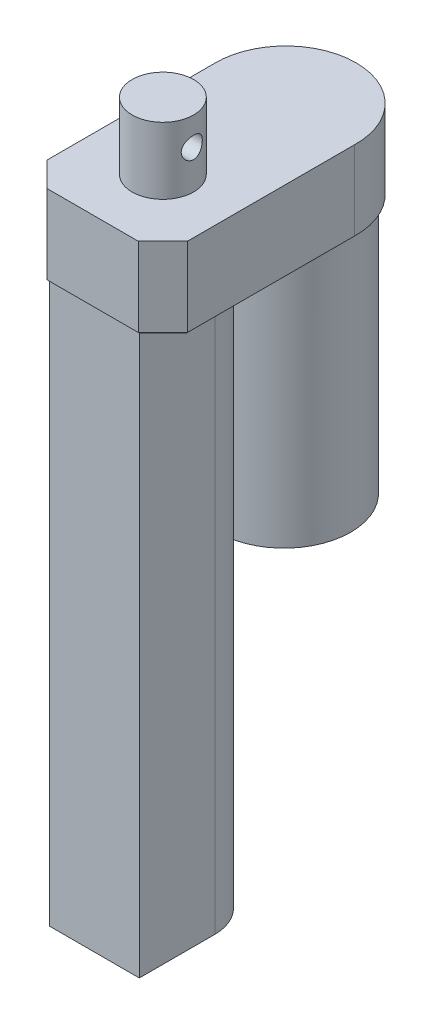
ISO-10303-21;
HEADER;
FILE_DESCRIPTION(('STEP AP214'),'2;1');
FILE_NAME('part.step','',(''),(''),'','','');
FILE_SCHEMA(('AUTOMOTIVE_DESIGN { 1 0 10303 214 1 1 1 1 }'));
ENDSEC;
DATA;
#1=APPLICATION_CONTEXT('core data for automotive mechanical design processes');
#2=APPLICATION_PROTOCOL_DEFINITION('international standard','automotive_design',2000,#1);
#3=PRODUCT_CONTEXT('',#1,'mechanical');
#4=PRODUCT('Part','Part','',(#3));
#5=PRODUCT_RELATED_PRODUCT_CATEGORY('part','',(#4));
#6=PRODUCT_DEFINITION_FORMATION('','',#4);
#7=PRODUCT_DEFINITION_CONTEXT('part definition',#1,'design');
#8=PRODUCT_DEFINITION('design','',#6,#7);
#9=PRODUCT_DEFINITION_SHAPE('','',#8);
#10=(LENGTH_UNIT() NAMED_UNIT(*) SI_UNIT(.MILLI.,.METRE.));
#11=(NAMED_UNIT(*) PLANE_ANGLE_UNIT() SI_UNIT($,.RADIAN.));
#12=(NAMED_UNIT(*) SI_UNIT($,.STERADIAN.) SOLID_ANGLE_UNIT());
#13=UNCERTAINTY_MEASURE_WITH_UNIT(LENGTH_MEASURE(1.E-05),#10,'distance_accuracy_value','');
#14=(GEOMETRIC_REPRESENTATION_CONTEXT(3) GLOBAL_UNCERTAINTY_ASSIGNED_CONTEXT((#13)) GLOBAL_UNIT_ASSIGNED_CONTEXT((#10,
#11,#12)) REPRESENTATION_CONTEXT('',''));
#15=CARTESIAN_POINT('',(0.,0.,0.));
#16=DIRECTION('',(0.,0.,1.));
#17=DIRECTION('',(1.,0.,0.));
#18=AXIS2_PLACEMENT_3D('',#15,#16,#17);
#19=CARTESIAN_POINT('',(0.,0.,-27.7439024390244));
#20=DIRECTION('',(0.,1.,0.));
#21=DIRECTION('',(0.,0.,1.));
#22=AXIS2_PLACEMENT_3D('',#19,#20,#21);
#23=PLANE('',#22);
#24=CARTESIAN_POINT('',(0.,0.,-27.25));
#25=DIRECTION('',(0.,1.,0.));
#26=DIRECTION('',(0.,0.,1.));
#27=AXIS2_PLACEMENT_3D('',#24,#25,#26);
#28=CIRCLE('',#27,19.);
#29=CARTESIAN_POINT('',(0.,0.,-8.25));
#30=VERTEX_POINT('',#29);
#31=EDGE_CURVE('E11',#30,#30,#28,.F.);
#32=ORIENTED_EDGE('',*,*,#31,.F.);
#33=EDGE_LOOP('',(#32));
#34=FACE_BOUND('',#33,.T.);
#35=DIRECTION('',(0.,0.,-1.));
#36=VECTOR('',#35,1.);
#37=CARTESIAN_POINT('',(-12.7928932188134,0.,0.));
#38=LINE('',#37,#36);
#39=CARTESIAN_POINT('',(-12.7928932188134,0.,26.75));
#40=VERTEX_POINT('',#39);
#41=CARTESIAN_POINT('',(-12.7928932188134,0.,5.25));
#42=VERTEX_POINT('',#41);
#43=EDGE_CURVE('E154',#40,#42,#38,.T.);
#44=ORIENTED_EDGE('',*,*,#43,.F.);
#45=DIRECTION('',(-0.707106781186546,0.,-0.707106781186549));
#46=VECTOR('',#45,1.);
#47=CARTESIAN_POINT('',(-19.6464466094067,0.,19.8964466094067));
#48=LINE('',#47,#46);
#49=CARTESIAN_POINT('',(-19.5,0.,20.0428932188134));
#50=VERTEX_POINT('',#49);
#51=EDGE_CURVE('E214',#40,#50,#48,.T.);
#52=ORIENTED_EDGE('',*,*,#51,.T.);
#53=DIRECTION('',(0.,0.,-1.));
#54=VECTOR('',#53,1.);
#55=CARTESIAN_POINT('',(-19.5,0.,-27.7439024390244));
#56=LINE('',#55,#54);
#57=CARTESIAN_POINT('',(-19.5,0.,-27.256211903645));
#58=VERTEX_POINT('',#57);
#59=EDGE_CURVE('E216',#50,#58,#56,.T.);
#60=ORIENTED_EDGE('',*,*,#59,.T.);
#61=CARTESIAN_POINT('',(0.,0.,-27.7439024390244));
#62=DIRECTION('',(0.,1.,0.));
#63=DIRECTION('',(0.,0.,1.));
#64=AXIS2_PLACEMENT_3D('',#61,#62,#63);
#65=CIRCLE('',#64,19.5060975609756);
#66=CARTESIAN_POINT('',(19.5,0.,-27.256211903645));
#67=VERTEX_POINT('',#66);
#68=EDGE_CURVE('E218',#58,#67,#65,.F.);
#69=ORIENTED_EDGE('',*,*,#68,.T.);
#70=DIRECTION('',(0.,0.,1.));
#71=VECTOR('',#70,1.);
#72=CARTESIAN_POINT('',(19.5,0.,-27.7439024390244));
#73=LINE('',#72,#71);
#74=CARTESIAN_POINT('',(19.5,0.,20.0428932188135));
#75=VERTEX_POINT('',#74);
#76=EDGE_CURVE('E207',#67,#75,#73,.T.);
#77=ORIENTED_EDGE('',*,*,#76,.T.);
#78=DIRECTION('',(-0.707106781186549,0.,0.707106781186546));
#79=VECTOR('',#78,1.);
#80=CARTESIAN_POINT('',(12.6464466094067,0.,26.8964466094067));
#81=LINE('',#80,#79);
#82=CARTESIAN_POINT('',(12.7928932188134,0.,26.75));
#83=VERTEX_POINT('',#82);
#84=EDGE_CURVE('E209',#75,#83,#81,.T.);
#85=ORIENTED_EDGE('',*,*,#84,.T.);
#86=DIRECTION('',(0.,0.,1.));
#87=VECTOR('',#86,1.);
#88=CARTESIAN_POINT('',(12.7928932188134,0.,0.));
#89=LINE('',#88,#87);
#90=CARTESIAN_POINT('',(12.7928932188134,0.,5.25));
#91=VERTEX_POINT('',#90);
#92=EDGE_CURVE('E65',#91,#83,#89,.T.);
#93=ORIENTED_EDGE('',*,*,#92,.F.);
#94=CARTESIAN_POINT('',(0.,0.,5.25));
#95=DIRECTION('',(0.,-1.,0.));
#96=DIRECTION('',(0.,0.,-1.));
#97=AXIS2_PLACEMENT_3D('',#94,#95,#96);
#98=CIRCLE('',#97,12.7928932188134);
#99=EDGE_CURVE('E60',#42,#91,#98,.T.);
#100=ORIENTED_EDGE('',*,*,#99,.F.);
#101=EDGE_LOOP('',(#44,#52,#60,#69,#77,#85,#93,#100));
#102=FACE_BOUND('',#101,.T.);
#103=ADVANCED_FACE('F38',(#34,#102),#23,.F.);
#104=CARTESIAN_POINT('',(0.,23.,-27.7439024390244));
#105=DIRECTION('',(0.,-1.,0.));
#106=DIRECTION('',(0.,0.,-1.));
#107=AXIS2_PLACEMENT_3D('',#104,#105,#106);
#108=CYLINDRICAL_SURFACE('',#107,20.0060975609756);
#109=DIRECTION('',(0.,-1.,0.));
#110=VECTOR('',#109,1.);
#111=CARTESIAN_POINT('',(20.,23.,-27.25));
#112=LINE('',#111,#110);
#113=CARTESIAN_POINT('',(20.,23.,-27.25));
#114=VERTEX_POINT('',#113);
#115=CARTESIAN_POINT('',(20.,0.5,-27.25));
#116=VERTEX_POINT('',#115);
#117=EDGE_CURVE('E184',#114,#116,#112,.T.);
#118=ORIENTED_EDGE('',*,*,#117,.T.);
#119=CARTESIAN_POINT('',(0.,0.5,-27.7439024390244));
#120=DIRECTION('',(0.,1.,0.));
#121=DIRECTION('',(0.,0.,1.));
#122=AXIS2_PLACEMENT_3D('',#119,#120,#121);
#123=CIRCLE('',#122,20.0060975609756);
#124=CARTESIAN_POINT('',(-20.,0.5,-27.25));
#125=VERTEX_POINT('',#124);
#126=EDGE_CURVE('E204',#116,#125,#123,.T.);
#127=ORIENTED_EDGE('',*,*,#126,.T.);
#128=DIRECTION('',(0.,-1.,0.));
#129=VECTOR('',#128,1.);
#130=CARTESIAN_POINT('',(-20.,23.,-27.25));
#131=LINE('',#130,#129);
#132=CARTESIAN_POINT('',(-20.,23.,-27.25));
#133=VERTEX_POINT('',#132);
#134=EDGE_CURVE('E187',#133,#125,#131,.T.);
#135=ORIENTED_EDGE('',*,*,#134,.F.);
#136=CARTESIAN_POINT('',(0.,23.,-27.7439024390244));
#137=DIRECTION('',(0.,1.,0.));
#138=DIRECTION('',(0.,0.,1.));
#139=AXIS2_PLACEMENT_3D('',#136,#137,#138);
#140=CIRCLE('',#139,20.0060975609756);
#141=EDGE_CURVE('E169',#114,#133,#140,.T.);
#142=ORIENTED_EDGE('',*,*,#141,.F.);
#143=EDGE_LOOP('',(#118,#127,#135,#142));
#144=FACE_BOUND('',#143,.T.);
#145=ADVANCED_FACE('F269',(#144),#108,.T.);
#146=CARTESIAN_POINT('',(-20.,23.,27.25));
#147=DIRECTION('',(1.,0.,0.));
#148=DIRECTION('',(0.,0.,-1.));
#149=AXIS2_PLACEMENT_3D('',#146,#147,#148);
#150=PLANE('',#149);
#151=ORIENTED_EDGE('',*,*,#134,.T.);
#152=DIRECTION('',(0.,0.,1.));
#153=VECTOR('',#152,1.);
#154=CARTESIAN_POINT('',(-20.,0.5,27.25));
#155=LINE('',#154,#153);
#156=CARTESIAN_POINT('',(-20.,0.5,20.25));
#157=VERTEX_POINT('',#156);
#158=EDGE_CURVE('E221',#125,#157,#155,.T.);
#159=ORIENTED_EDGE('',*,*,#158,.T.);
#160=DIRECTION('',(0.,1.,0.));
#161=VECTOR('',#160,1.);
#162=CARTESIAN_POINT('',(-20.,23.,20.25));
#163=LINE('',#162,#161);
#164=CARTESIAN_POINT('',(-20.,23.,20.25));
#165=VERTEX_POINT('',#164);
#166=EDGE_CURVE('E202',#157,#165,#163,.T.);
#167=ORIENTED_EDGE('',*,*,#166,.T.);
#168=DIRECTION('',(0.,0.,1.));
#169=VECTOR('',#168,1.);
#170=CARTESIAN_POINT('',(-20.,23.,27.25));
#171=LINE('',#170,#169);
#172=EDGE_CURVE('E176',#133,#165,#171,.T.);
#173=ORIENTED_EDGE('',*,*,#172,.F.);
#174=EDGE_LOOP('',(#151,#159,#167,#173));
#175=FACE_BOUND('',#174,.T.);
#176=ADVANCED_FACE('F275',(#175),#150,.F.);
#177=CARTESIAN_POINT('',(-20.,23.,27.25));
#178=DIRECTION('',(0.,0.,-1.));
#179=DIRECTION('',(-1.,0.,0.));
#180=AXIS2_PLACEMENT_3D('',#177,#178,#179);
#181=PLANE('',#180);
#182=DIRECTION('',(0.,-1.,0.));
#183=VECTOR('',#182,1.);
#184=CARTESIAN_POINT('',(-13.,23.,27.25));
#185=LINE('',#184,#183);
#186=CARTESIAN_POINT('',(-13.,23.,27.25));
#187=VERTEX_POINT('',#186);
#188=CARTESIAN_POINT('',(-13.,0.5,27.25));
#189=VERTEX_POINT('',#188);
#190=EDGE_CURVE('E193',#187,#189,#185,.T.);
#191=ORIENTED_EDGE('',*,*,#190,.T.);
#192=DIRECTION('',(1.,0.,0.));
#193=VECTOR('',#192,1.);
#194=CARTESIAN_POINT('',(-20.,0.5,27.25));
#195=LINE('',#194,#193);
#196=CARTESIAN_POINT('',(13.,0.5,27.25));
#197=VERTEX_POINT('',#196);
#198=EDGE_CURVE('E225',#189,#197,#195,.T.);
#199=ORIENTED_EDGE('',*,*,#198,.T.);
#200=DIRECTION('',(0.,1.,0.));
#201=VECTOR('',#200,1.);
#202=CARTESIAN_POINT('',(13.,23.,27.25));
#203=LINE('',#202,#201);
#204=CARTESIAN_POINT('',(13.,23.,27.25));
#205=VERTEX_POINT('',#204);
#206=EDGE_CURVE('E196',#197,#205,#203,.T.);
#207=ORIENTED_EDGE('',*,*,#206,.T.);
#208=DIRECTION('',(1.,0.,0.));
#209=VECTOR('',#208,1.);
#210=CARTESIAN_POINT('',(-20.,23.,27.25));
#211=LINE('',#210,#209);
#212=EDGE_CURVE('E179',#187,#205,#211,.T.);
#213=ORIENTED_EDGE('',*,*,#212,.F.);
#214=EDGE_LOOP('',(#191,#199,#207,#213));
#215=FACE_BOUND('',#214,.T.);
#216=ADVANCED_FACE('F285',(#215),#181,.F.);
#217=CARTESIAN_POINT('',(20.,23.,27.25));
#218=DIRECTION('',(-1.,0.,0.));
#219=DIRECTION('',(0.,0.,1.));
#220=AXIS2_PLACEMENT_3D('',#217,#218,#219);
#221=PLANE('',#220);
#222=DIRECTION('',(0.,-1.,0.));
#223=VECTOR('',#222,1.);
#224=CARTESIAN_POINT('',(20.,23.,20.25));
#225=LINE('',#224,#223);
#226=CARTESIAN_POINT('',(20.,23.,20.25));
#227=VERTEX_POINT('',#226);
#228=CARTESIAN_POINT('',(20.,0.5,20.25));
#229=VERTEX_POINT('',#228);
#230=EDGE_CURVE('E190',#227,#229,#225,.T.);
#231=ORIENTED_EDGE('',*,*,#230,.T.);
#232=DIRECTION('',(0.,0.,-1.));
#233=VECTOR('',#232,1.);
#234=CARTESIAN_POINT('',(20.,0.5,27.25));
#235=LINE('',#234,#233);
#236=EDGE_CURVE('E52',#229,#116,#235,.T.);
#237=ORIENTED_EDGE('',*,*,#236,.T.);
#238=ORIENTED_EDGE('',*,*,#117,.F.);
#239=DIRECTION('',(0.,0.,-1.));
#240=VECTOR('',#239,1.);
#241=CARTESIAN_POINT('',(20.,23.,27.25));
#242=LINE('',#241,#240);
#243=EDGE_CURVE('E182',#227,#114,#242,.T.);
#244=ORIENTED_EDGE('',*,*,#243,.F.);
#245=EDGE_LOOP('',(#231,#237,#238,#244));
#246=FACE_BOUND('',#245,.T.);
#247=ADVANCED_FACE('F282',(#246),#221,.F.);
#248=CARTESIAN_POINT('',(0.,23.,-27.7439024390244));
#249=DIRECTION('',(0.,1.,0.));
#250=DIRECTION('',(0.,0.,1.));
#251=AXIS2_PLACEMENT_3D('',#248,#249,#250);
#252=PLANE('',#251);
#253=CARTESIAN_POINT('',(0.,23.,7.25));
#254=DIRECTION('',(0.,1.,0.));
#255=DIRECTION('',(0.,0.,1.));
#256=AXIS2_PLACEMENT_3D('',#253,#254,#255);
#257=CIRCLE('',#256,8.75);
#258=CARTESIAN_POINT('',(0.,23.,16.));
#259=VERTEX_POINT('',#258);
#260=EDGE_CURVE('E170',#259,#259,#257,.T.);
#261=ORIENTED_EDGE('',*,*,#260,.F.);
#262=EDGE_LOOP('',(#261));
#263=FACE_BOUND('',#262,.T.);
#264=ORIENTED_EDGE('',*,*,#212,.T.);
#265=DIRECTION('',(-0.707106781186549,0.,0.707106781186546));
#266=VECTOR('',#265,1.);
#267=CARTESIAN_POINT('',(33.9969512195122,23.,6.25304878048787));
#268=LINE('',#267,#266);
#269=EDGE_CURVE('E200',#205,#227,#268,.F.);
#270=ORIENTED_EDGE('',*,*,#269,.T.);
#271=ORIENTED_EDGE('',*,*,#243,.T.);
#272=ORIENTED_EDGE('',*,*,#141,.T.);
#273=ORIENTED_EDGE('',*,*,#172,.T.);
#274=DIRECTION('',(-0.707106781186546,0.,-0.707106781186549));
#275=VECTOR('',#274,1.);
#276=CARTESIAN_POINT('',(-33.9969512195122,23.,6.25304878048772));
#277=LINE('',#276,#275);
#278=EDGE_CURVE('E198',#165,#187,#277,.F.);
#279=ORIENTED_EDGE('',*,*,#278,.T.);
#280=EDGE_LOOP('',(#264,#270,#271,#272,#273,#279));
#281=FACE_BOUND('',#280,.T.);
#282=ADVANCED_FACE('F281',(#263,#281),#252,.T.);
#283=CARTESIAN_POINT('',(20.,23.,20.25));
#284=DIRECTION('',(-0.707106781186546,0.,-0.707106781186549));
#285=DIRECTION('',(0.,-1.,0.));
#286=AXIS2_PLACEMENT_3D('',#283,#284,#285);
#287=PLANE('',#286);
#288=ORIENTED_EDGE('',*,*,#206,.F.);
#289=DIRECTION('',(-0.707106781186549,0.,0.707106781186546));
#290=VECTOR('',#289,1.);
#291=CARTESIAN_POINT('',(20.,0.5,20.25));
#292=LINE('',#291,#290);
#293=EDGE_CURVE('E227',#197,#229,#292,.F.);
#294=ORIENTED_EDGE('',*,*,#293,.T.);
#295=ORIENTED_EDGE('',*,*,#230,.F.);
#296=ORIENTED_EDGE('',*,*,#269,.F.);
#297=EDGE_LOOP('',(#288,#294,#295,#296));
#298=FACE_BOUND('',#297,.T.);
#299=ADVANCED_FACE('F293',(#298),#287,.F.);
#300=CARTESIAN_POINT('',(-13.,23.,27.25));
#301=DIRECTION('',(0.707106781186549,0.,-0.707106781186546));
#302=DIRECTION('',(0.,-1.,0.));
#303=AXIS2_PLACEMENT_3D('',#300,#301,#302);
#304=PLANE('',#303);
#305=ORIENTED_EDGE('',*,*,#166,.F.);
#306=DIRECTION('',(-0.707106781186546,0.,-0.707106781186549));
#307=VECTOR('',#306,1.);
#308=CARTESIAN_POINT('',(-13.,0.500000000000001,27.25));
#309=LINE('',#308,#307);
#310=EDGE_CURVE('E223',#157,#189,#309,.F.);
#311=ORIENTED_EDGE('',*,*,#310,.T.);
#312=ORIENTED_EDGE('',*,*,#190,.F.);
#313=ORIENTED_EDGE('',*,*,#278,.F.);
#314=EDGE_LOOP('',(#305,#311,#312,#313));
#315=FACE_BOUND('',#314,.T.);
#316=ADVANCED_FACE('F295',(#315),#304,.F.);
#317=CARTESIAN_POINT('',(0.,42.,7.25));
#318=DIRECTION('',(0.,-1.,0.));
#319=DIRECTION('',(0.,0.,-1.));
#320=AXIS2_PLACEMENT_3D('',#317,#318,#319);
#321=CYLINDRICAL_SURFACE('',#320,8.75);
#322=CARTESIAN_POINT('',(-8.2196411113868,34.,4.25));
#323=CARTESIAN_POINT('',(-8.21963966696499,34.1631026677264,4.24999821199337));
#324=CARTESIAN_POINT('',(-8.22454879313556,34.3261930090845,4.26334607855193));
#325=CARTESIAN_POINT('',(-8.24354529034157,34.6475229389937,4.31619133361418));
#326=CARTESIAN_POINT('',(-8.25763374103735,34.8057619546453,4.35569179816168));
#327=CARTESIAN_POINT('',(-8.29320953916202,35.1126783509252,4.45927637699315));
#328=CARTESIAN_POINT('',(-8.31468169000744,35.2613746316122,4.52331002955212));
#329=CARTESIAN_POINT('',(-8.36258290594314,35.5459647520904,4.67396938643779));
#330=CARTESIAN_POINT('',(-8.38901316058877,35.6818555077828,4.76060051433486));
#331=CARTESIAN_POINT('',(-8.44508015335536,35.942606039379,4.95783961590905));
#332=CARTESIAN_POINT('',(-8.47480011343842,36.0668585110533,5.0692269904548));
#333=CARTESIAN_POINT('',(-8.53339647944575,36.2953371918525,5.31115547250579));
#334=CARTESIAN_POINT('',(-8.56227274016146,36.3995599706962,5.4416998540969));
#335=CARTESIAN_POINT('',(-8.61689727547401,36.5878130452084,5.72271457310106));
#336=CARTESIAN_POINT('',(-8.64253634317682,36.6712018148212,5.87363778054657));
#337=CARTESIAN_POINT('',(-8.68681281914156,36.8111646786476,6.18840043871628));
#338=CARTESIAN_POINT('',(-8.70545223081177,36.8677464466486,6.35223617740962));
#339=CARTESIAN_POINT('',(-8.73303950244701,36.9504144080879,6.68180185040079));
#340=CARTESIAN_POINT('',(-8.74231746635867,36.9775420898004,6.84724238566389));
#341=CARTESIAN_POINT('',(-8.7513110578293,37.0038489637629,7.18057007356003));
#342=CARTESIAN_POINT('',(-8.75102928980447,37.0030357681162,7.34845654737247));
#343=CARTESIAN_POINT('',(-8.74115588060926,36.9741327793623,7.67451840318935));
#344=CARTESIAN_POINT('',(-8.73195074331423,36.947175366136,7.83280780717064));
#345=CARTESIAN_POINT('',(-8.70575489999197,36.8686288000134,8.14246230437054));
#346=CARTESIAN_POINT('',(-8.68876365908347,36.8170379548663,8.2938269210918));
#347=CARTESIAN_POINT('',(-8.64842501286197,36.6900584980084,8.58774682084455));
#348=CARTESIAN_POINT('',(-8.62499479354297,36.6143576296963,8.7301553676012));
#349=CARTESIAN_POINT('',(-8.57420241941931,36.4415680779828,9.00057446449465));
#350=CARTESIAN_POINT('',(-8.54683912884594,36.3444732122198,9.12858083655643));
#351=CARTESIAN_POINT('',(-8.48944850567277,36.1259988728825,9.3732864729827));
#352=CARTESIAN_POINT('',(-8.45935635609438,36.0036533413404,9.48910931619769));
#353=CARTESIAN_POINT('',(-8.40103160366621,35.7410338478009,9.69888789551482));
#354=CARTESIAN_POINT('',(-8.37279932364301,35.6007567857005,9.79283984251247));
#355=CARTESIAN_POINT('',(-8.32102377112971,35.3033322988642,9.95751950566393));
#356=CARTESIAN_POINT('',(-8.2975619198116,35.1459527022397,10.0278554782275));
#357=CARTESIAN_POINT('',(-8.25892402122806,34.8205738756784,10.1407222309304));
#358=CARTESIAN_POINT('',(-8.24374425888971,34.6525794450036,10.1832654796652));
#359=CARTESIAN_POINT('',(-8.22423759406534,34.319270193321,10.2375093937651));
#360=CARTESIAN_POINT('',(-8.21943030120823,34.1542059006265,10.2505766127404));
#361=CARTESIAN_POINT('',(-8.21986609325329,33.8242081805408,10.249384558195));
#362=CARTESIAN_POINT('',(-8.22510721427078,33.6592747338794,10.2351306243822));
#363=CARTESIAN_POINT('',(-8.24456830823428,33.3406032709185,10.1809315627575));
#364=CARTESIAN_POINT('',(-8.25844819778452,33.1866768929378,10.1419584952316));
#365=CARTESIAN_POINT('',(-8.29324232389215,32.8875871163843,10.0406061457153));
#366=CARTESIAN_POINT('',(-8.3141578521977,32.7424253327738,9.97822256529509));
#367=CARTESIAN_POINT('',(-8.36152229337208,32.4596592391811,9.82947906160251));
#368=CARTESIAN_POINT('',(-8.38813137799001,32.3224638408889,9.74239419482448));
#369=CARTESIAN_POINT('',(-8.44358342820308,32.064141171528,9.54753030073554));
#370=CARTESIAN_POINT('',(-8.47242708698829,31.9430189183965,9.43974483640611));
#371=CARTESIAN_POINT('',(-8.5308903700107,31.7138442880211,9.19996900691919));
#372=CARTESIAN_POINT('',(-8.56047373735717,31.6067829763372,9.06701964834227));
#373=CARTESIAN_POINT('',(-8.61563093416445,31.4164136636205,8.78431267120997));
#374=CARTESIAN_POINT('',(-8.64120487981175,31.3331049742183,8.63455553993225));
#375=CARTESIAN_POINT('',(-8.68535987286581,31.1933362112036,8.32311716911724));
#376=CARTESIAN_POINT('',(-8.70398280844663,31.1367147529628,8.16151461612874));
#377=CARTESIAN_POINT('',(-8.73231423186321,31.0517059044869,7.83031163558396));
#378=CARTESIAN_POINT('',(-8.74202614581118,31.0233076626317,7.66071430825193));
#379=CARTESIAN_POINT('',(-8.75116789234191,30.9965720145565,7.32737571744395));
#380=CARTESIAN_POINT('',(-8.75108311611696,30.9968155225997,7.16376039845709));
#381=CARTESIAN_POINT('',(-8.74185154282233,31.023823058207,6.83901025845031));
#382=CARTESIAN_POINT('',(-8.73270555403372,31.0505847202907,6.67787521748582));
#383=CARTESIAN_POINT('',(-8.70656769128771,31.1289125222774,6.36550014016176));
#384=CARTESIAN_POINT('',(-8.68971687054434,31.1800333957826,6.21413579640993));
#385=CARTESIAN_POINT('',(-8.64990647437029,31.3052102418289,5.92208285407036));
#386=CARTESIAN_POINT('',(-8.62694577482648,31.379270435224,5.78139622612738));
#387=CARTESIAN_POINT('',(-8.5761737217924,31.5514762670169,5.50882064815411));
#388=CARTESIAN_POINT('',(-8.54821044613054,31.6504346856282,5.37747390102216));
#389=CARTESIAN_POINT('',(-8.49092159348734,31.8682685540706,5.13279185270617));
#390=CARTESIAN_POINT('',(-8.46159557157982,31.9871505422868,5.01946248821678));
#391=CARTESIAN_POINT('',(-8.40340801901877,32.2474316909771,4.80916985898143));
#392=CARTESIAN_POINT('',(-8.37461796951372,32.3895678964295,4.71309601680038));
#393=CARTESIAN_POINT('',(-8.32225317575394,32.688873264318,4.5462462043968));
#394=CARTESIAN_POINT('',(-8.29867745126572,32.8460395932918,4.4754654778148));
#395=CARTESIAN_POINT('',(-8.26025973071726,33.1668972288271,4.36312123829911));
#396=CARTESIAN_POINT('',(-8.24520703193571,33.3303134963923,4.32084741203481));
#397=CARTESIAN_POINT('',(-8.22490043606385,33.662492356516,4.26429333610913));
#398=CARTESIAN_POINT('',(-8.21964260579627,33.831252775407,4.25000184988486));
#399=CARTESIAN_POINT('',(-8.2196411113868,34.,4.25));
#400=B_SPLINE_CURVE_WITH_KNOTS('',3,(#322,#323,#324,#325,#326,#327,#328,#329,#330,#331,#332,
#333,#334,#335,#336,#337,#338,#339,#340,#341,#342,#343,#344,#345,#346,#347,#348,#349,#350,#351,
#352,#353,#354,#355,#356,#357,#358,#359,#360,#361,#362,#363,#364,#365,#366,#367,#368,#369,#370,
#371,#372,#373,#374,#375,#376,#377,#378,#379,#380,#381,#382,#383,#384,#385,#386,#387,#388,#389,
#390,#391,#392,#393,#394,#395,#396,#397,#398,#399),.UNSPECIFIED.,.T.,.F.,(4,2,2,2,2,2,2,2,2,2,2,
2,2,2,2,2,2,2,2,2,2,2,2,2,2,2,2,2,2,2,2,2,2,2,2,2,2,2,4),(0.,0.488682337219747,
0.977422163006771,1.46516206218575,1.95301913062753,2.45922932278978,2.9655261313039,
3.48589073327405,4.00610628524081,4.5072593455663,5.00827587479767,5.48851853048441,
5.96879418230657,6.45556189842432,6.9424704638653,7.4535433316787,7.96470467641856,
8.48396864418949,9.00299949530807,9.4974244192431,9.99175272150508,10.4677544221134,
10.9438435647083,11.4356834532261,11.9276765317009,12.4449440528246,12.9621965816088,
13.4762796922962,13.9901650652326,14.4786007186933,14.966992806489,15.446781266494,
15.9266580604689,16.4248866674341,16.9232791010886,17.4426450771838,17.9619133352713,
18.467710839701,18.9733051948578),.UNSPECIFIED.);
#401=CARTESIAN_POINT('',(-8.2196411113868,34.,4.25));
#402=VERTEX_POINT('',#401);
#403=EDGE_CURVE('E42',#402,#402,#400,.T.);
#404=ORIENTED_EDGE('',*,*,#403,.T.);
#405=EDGE_LOOP('',(#404));
#406=FACE_BOUND('',#405,.T.);
#407=CARTESIAN_POINT('',(8.2196411113868,34.,4.25));
#408=CARTESIAN_POINT('',(8.21963966696499,33.8368973322736,4.24999821199337));
#409=CARTESIAN_POINT('',(8.22454879313556,33.6738069909155,4.26334607855193));
#410=CARTESIAN_POINT('',(8.24354529034157,33.3524770610063,4.31619133361418));
#411=CARTESIAN_POINT('',(8.25763374103735,33.1942380453547,4.35569179816168));
#412=CARTESIAN_POINT('',(8.29320953916202,32.8873216490748,4.45927637699315));
#413=CARTESIAN_POINT('',(8.31468169000744,32.7386253683878,4.52331002955212));
#414=CARTESIAN_POINT('',(8.36258290594314,32.4540352479096,4.67396938643779));
#415=CARTESIAN_POINT('',(8.38901316058877,32.3181444922172,4.76060051433486));
#416=CARTESIAN_POINT('',(8.44508015335536,32.057393960621,4.95783961590905));
#417=CARTESIAN_POINT('',(8.47480011343842,31.9331414889467,5.0692269904548));
#418=CARTESIAN_POINT('',(8.53339647944575,31.7046628081475,5.31115547250579));
#419=CARTESIAN_POINT('',(8.56227274016146,31.6004400293038,5.4416998540969));
#420=CARTESIAN_POINT('',(8.61689727547401,31.4121869547916,5.72271457310106));
#421=CARTESIAN_POINT('',(8.64253634317682,31.3287981851788,5.87363778054657));
#422=CARTESIAN_POINT('',(8.68681281914156,31.1888353213524,6.18840043871628));
#423=CARTESIAN_POINT('',(8.70545223081177,31.1322535533514,6.35223617740962));
#424=CARTESIAN_POINT('',(8.73303950244701,31.0495855919121,6.68180185040079));
#425=CARTESIAN_POINT('',(8.74231746635867,31.0224579101996,6.84724238566389));
#426=CARTESIAN_POINT('',(8.7513110578293,30.996151036237,7.18057007356003));
#427=CARTESIAN_POINT('',(8.75102928980447,30.9969642318838,7.34845654737247));
#428=CARTESIAN_POINT('',(8.74115588060926,31.0258672206377,7.67451840318935));
#429=CARTESIAN_POINT('',(8.73195074331423,31.052824633864,7.83280780717064));
#430=CARTESIAN_POINT('',(8.70575489999197,31.1313711999866,8.14246230437054));
#431=CARTESIAN_POINT('',(8.68876365908347,31.1829620451337,8.2938269210918));
#432=CARTESIAN_POINT('',(8.64842501286197,31.3099415019915,8.58774682084455));
#433=CARTESIAN_POINT('',(8.62499479354297,31.3856423703037,8.7301553676012));
#434=CARTESIAN_POINT('',(8.57420241941931,31.5584319220172,9.00057446449465));
#435=CARTESIAN_POINT('',(8.54683912884594,31.6555267877801,9.12858083655643));
#436=CARTESIAN_POINT('',(8.48944850567277,31.8740011271175,9.3732864729827));
#437=CARTESIAN_POINT('',(8.45935635609438,31.9963466586595,9.48910931619769));
#438=CARTESIAN_POINT('',(8.40103160366621,32.2589661521991,9.69888789551482));
#439=CARTESIAN_POINT('',(8.372799323643,32.3992432142995,9.79283984251248));
#440=CARTESIAN_POINT('',(8.32102377112971,32.6966677011358,9.95751950566393));
#441=CARTESIAN_POINT('',(8.2975619198116,32.8540472977603,10.0278554782275));
#442=CARTESIAN_POINT('',(8.25892402122806,33.1794261243216,10.1407222309304));
#443=CARTESIAN_POINT('',(8.24374425888971,33.3474205549964,10.1832654796652));
#444=CARTESIAN_POINT('',(8.22423759406534,33.680729806679,10.2375093937651));
#445=CARTESIAN_POINT('',(8.21943030120823,33.8457940993735,10.2505766127404));
#446=CARTESIAN_POINT('',(8.21986609325329,34.1757918194592,10.249384558195));
#447=CARTESIAN_POINT('',(8.22510721427078,34.3407252661206,10.2351306243822));
#448=CARTESIAN_POINT('',(8.24456830823428,34.6593967290815,10.1809315627575));
#449=CARTESIAN_POINT('',(8.25844819778452,34.8133231070622,10.1419584952316));
#450=CARTESIAN_POINT('',(8.29324232389215,35.1124128836157,10.0406061457153));
#451=CARTESIAN_POINT('',(8.3141578521977,35.2575746672262,9.97822256529509));
#452=CARTESIAN_POINT('',(8.36152229337208,35.5403407608189,9.82947906160251));
#453=CARTESIAN_POINT('',(8.38813137799001,35.6775361591111,9.74239419482448));
#454=CARTESIAN_POINT('',(8.44358342820307,35.935858828472,9.54753030073555));
#455=CARTESIAN_POINT('',(8.47242708698829,36.0569810816035,9.43974483640611));
#456=CARTESIAN_POINT('',(8.5308903700107,36.2861557119789,9.19996900691919));
#457=CARTESIAN_POINT('',(8.56047373735717,36.3932170236628,9.06701964834227));
#458=CARTESIAN_POINT('',(8.61563093416445,36.5835863363795,8.78431267120997));
#459=CARTESIAN_POINT('',(8.64120487981175,36.6668950257817,8.63455553993225));
#460=CARTESIAN_POINT('',(8.68535987286581,36.8066637887964,8.32311716911724));
#461=CARTESIAN_POINT('',(8.70398280844663,36.8632852470372,8.16151461612873));
#462=CARTESIAN_POINT('',(8.73231423186321,36.9482940955131,7.83031163558395));
#463=CARTESIAN_POINT('',(8.74202614581118,36.9766923373683,7.66071430825192));
#464=CARTESIAN_POINT('',(8.75116789234191,37.0034279854435,7.32737571744395));
#465=CARTESIAN_POINT('',(8.75108311611696,37.0031844774003,7.16376039845709));
#466=CARTESIAN_POINT('',(8.74185154282233,36.976176941793,6.83901025845031));
#467=CARTESIAN_POINT('',(8.73270555403372,36.9494152797093,6.67787521748582));
#468=CARTESIAN_POINT('',(8.70656769128771,36.8710874777226,6.36550014016176));
#469=CARTESIAN_POINT('',(8.68971687054434,36.8199666042174,6.21413579640993));
#470=CARTESIAN_POINT('',(8.64990647437029,36.6947897581711,5.92208285407036));
#471=CARTESIAN_POINT('',(8.62694577482648,36.620729564776,5.78139622612737));
#472=CARTESIAN_POINT('',(8.5761737217924,36.4485237329831,5.5088206481541));
#473=CARTESIAN_POINT('',(8.54821044613054,36.3495653143718,5.37747390102216));
#474=CARTESIAN_POINT('',(8.49092159348735,36.1317314459294,5.13279185270617));
#475=CARTESIAN_POINT('',(8.46159557157982,36.0128494577132,5.01946248821678));
#476=CARTESIAN_POINT('',(8.40340801901877,35.7525683090229,4.80916985898143));
#477=CARTESIAN_POINT('',(8.37461796951372,35.6104321035704,4.71309601680038));
#478=CARTESIAN_POINT('',(8.32225317575394,35.311126735682,4.5462462043968));
#479=CARTESIAN_POINT('',(8.29867745126572,35.1539604067082,4.4754654778148));
#480=CARTESIAN_POINT('',(8.26025973071726,34.8331027711729,4.36312123829911));
#481=CARTESIAN_POINT('',(8.24520703193571,34.6696865036077,4.32084741203481));
#482=CARTESIAN_POINT('',(8.22490043606385,34.337507643484,4.26429333610913));
#483=CARTESIAN_POINT('',(8.21964260579627,34.168747224593,4.25000184988486));
#484=CARTESIAN_POINT('',(8.2196411113868,34.,4.25));
#485=B_SPLINE_CURVE_WITH_KNOTS('',3,(#407,#408,#409,#410,#411,#412,#413,#414,#415,#416,#417,
#418,#419,#420,#421,#422,#423,#424,#425,#426,#427,#428,#429,#430,#431,#432,#433,#434,#435,#436,
#437,#438,#439,#440,#441,#442,#443,#444,#445,#446,#447,#448,#449,#450,#451,#452,#453,#454,#455,
#456,#457,#458,#459,#460,#461,#462,#463,#464,#465,#466,#467,#468,#469,#470,#471,#472,#473,#474,
#475,#476,#477,#478,#479,#480,#481,#482,#483,#484),.UNSPECIFIED.,.T.,.F.,(4,2,2,2,2,2,2,2,2,2,2,
2,2,2,2,2,2,2,2,2,2,2,2,2,2,2,2,2,2,2,2,2,2,2,2,2,2,2,4),(0.,0.488682337219747,
0.977422163006771,1.46516206218575,1.95301913062753,2.45922932278978,2.9655261313039,
3.48589073327405,4.00610628524081,4.5072593455663,5.00827587479767,5.48851853048441,
5.96879418230657,6.45556189842433,6.9424704638653,7.4535433316787,7.96470467641856,
8.48396864418949,9.00299949530807,9.4974244192431,9.99175272150508,10.4677544221134,
10.9438435647083,11.4356834532261,11.9276765317009,12.4449440528246,12.9621965816088,
13.4762796922962,13.9901650652326,14.4786007186933,14.966992806489,15.446781266494,
15.9266580604689,16.4248866674341,16.9232791010886,17.4426450771838,17.9619133352713,
18.467710839701,18.9733051948578),.UNSPECIFIED.);
#486=CARTESIAN_POINT('',(8.2196411113868,34.,4.25));
#487=VERTEX_POINT('',#486);
#488=EDGE_CURVE('E155',#487,#487,#485,.T.);
#489=ORIENTED_EDGE('',*,*,#488,.T.);
#490=EDGE_LOOP('',(#489));
#491=FACE_BOUND('',#490,.T.);
#492=CARTESIAN_POINT('',(0.,42.,7.25));
#493=DIRECTION('',(0.,1.,0.));
#494=DIRECTION('',(0.,0.,1.));
#495=AXIS2_PLACEMENT_3D('',#492,#493,#494);
#496=CIRCLE('',#495,8.75);
#497=CARTESIAN_POINT('',(0.,42.,16.));
#498=VERTEX_POINT('',#497);
#499=EDGE_CURVE('E166',#498,#498,#496,.T.);
#500=ORIENTED_EDGE('',*,*,#499,.F.);
#501=EDGE_LOOP('',(#500));
#502=FACE_BOUND('',#501,.T.);
#503=ORIENTED_EDGE('',*,*,#260,.T.);
#504=EDGE_LOOP('',(#503));
#505=FACE_BOUND('',#504,.T.);
#506=ADVANCED_FACE('F298',(#406,#491,#502,#505),#321,.T.);
#507=CARTESIAN_POINT('',(0.,42.,7.25));
#508=DIRECTION('',(0.,1.,0.));
#509=DIRECTION('',(0.,0.,1.));
#510=AXIS2_PLACEMENT_3D('',#507,#508,#509);
#511=PLANE('',#510);
#512=ORIENTED_EDGE('',*,*,#499,.T.);
#513=EDGE_LOOP('',(#512));
#514=FACE_BOUND('',#513,.T.);
#515=ADVANCED_FACE('F265',(#514),#511,.T.);
#516=CARTESIAN_POINT('',(-20.,0.5,27.25));
#517=DIRECTION('',(0.,0.707106781186547,-0.707106781186547));
#518=DIRECTION('',(1.,0.,0.));
#519=AXIS2_PLACEMENT_3D('',#516,#517,#518);
#520=PLANE('',#519);
#521=DIRECTION('',(0.281084637714824,-0.678598344545846,-0.678598344545846));
#522=VECTOR('',#521,1.);
#523=CARTESIAN_POINT('',(-13.5530600149149,1.83520498881384,28.5852049888138));
#524=LINE('',#523,#522);
#525=EDGE_CURVE('E314',#40,#189,#524,.F.);
#526=ORIENTED_EDGE('',*,*,#525,.F.);
#527=DIRECTION('',(-1.,0.,0.));
#528=VECTOR('',#527,1.);
#529=CARTESIAN_POINT('',(0.,0.,26.75));
#530=LINE('',#529,#528);
#531=EDGE_CURVE('E211',#83,#40,#530,.T.);
#532=ORIENTED_EDGE('',*,*,#531,.F.);
#533=DIRECTION('',(-0.281084637714817,-0.678598344545848,-0.678598344545848));
#534=VECTOR('',#533,1.);
#535=CARTESIAN_POINT('',(10.4631621639491,-5.62446830933527,21.1255316906647));
#536=LINE('',#535,#534);
#537=EDGE_CURVE('E173',#197,#83,#536,.T.);
#538=ORIENTED_EDGE('',*,*,#537,.F.);
#539=ORIENTED_EDGE('',*,*,#198,.F.);
#540=EDGE_LOOP('',(#526,#532,#538,#539));
#541=FACE_BOUND('',#540,.T.);
#542=ADVANCED_FACE('F40',(#541),#520,.F.);
#543=CARTESIAN_POINT('',(33.6433978289189,0.,5.8994953898946));
#544=DIRECTION('',(-0.5,0.707106781186546,-0.500000000000002));
#545=DIRECTION('',(-0.707106781186549,0.,0.707106781186546));
#546=AXIS2_PLACEMENT_3D('',#543,#544,#545);
#547=PLANE('',#546);
#548=ORIENTED_EDGE('',*,*,#537,.T.);
#549=ORIENTED_EDGE('',*,*,#84,.F.);
#550=DIRECTION('',(-0.678598344545848,-0.678598344545848,-0.281084637714818));
#551=VECTOR('',#550,1.);
#552=CARTESIAN_POINT('',(21.3352049888138,1.83520498881381,20.8030600149149));
#553=LINE('',#552,#551);
#554=EDGE_CURVE('E317',#229,#75,#553,.T.);
#555=ORIENTED_EDGE('',*,*,#554,.F.);
#556=ORIENTED_EDGE('',*,*,#293,.F.);
#557=EDGE_LOOP('',(#548,#549,#555,#556));
#558=FACE_BOUND('',#557,.T.);
#559=ADVANCED_FACE('F258',(#558),#547,.F.);
#560=CARTESIAN_POINT('',(-33.6433978289189,0.,5.89949538989444));
#561=DIRECTION('',(0.5,0.707106781186549,-0.499999999999998));
#562=DIRECTION('',(-0.707106781186546,0.,-0.707106781186549));
#563=AXIS2_PLACEMENT_3D('',#560,#561,#562);
#564=PLANE('',#563);
#565=ORIENTED_EDGE('',*,*,#525,.T.);
#566=ORIENTED_EDGE('',*,*,#310,.F.);
#567=DIRECTION('',(0.678598344545847,-0.678598344545847,-0.281084637714823));
#568=VECTOR('',#567,1.);
#569=CARTESIAN_POINT('',(-23.3152118791657,3.81521187916574,21.6232057224908));
#570=LINE('',#569,#568);
#571=EDGE_CURVE('E311',#50,#157,#570,.F.);
#572=ORIENTED_EDGE('',*,*,#571,.F.);
#573=ORIENTED_EDGE('',*,*,#51,.F.);
#574=EDGE_LOOP('',(#565,#566,#572,#573));
#575=FACE_BOUND('',#574,.T.);
#576=ADVANCED_FACE('F255',(#575),#564,.F.);
#577=CARTESIAN_POINT('',(20.,0.5,27.25));
#578=DIRECTION('',(-0.707106781186547,0.707106781186547,0.));
#579=DIRECTION('',(0.,0.,-1.));
#580=AXIS2_PLACEMENT_3D('',#577,#578,#579);
#581=PLANE('',#580);
#582=ORIENTED_EDGE('',*,*,#554,.T.);
#583=ORIENTED_EDGE('',*,*,#76,.F.);
#584=CARTESIAN_POINT('',(19.5,0.,-27.256211903645));
#585=CARTESIAN_POINT('',(19.5833332926376,0.0833332926375673,-27.2551700349844));
#586=CARTESIAN_POINT('',(19.6666666056234,0.166666605623425,-27.2541314420171));
#587=CARTESIAN_POINT('',(19.8333332722901,0.333333272290092,-27.2520608074687));
#588=CARTESIAN_POINT('',(19.9166666259709,0.416666625970901,-27.2510287658878));
#589=CARTESIAN_POINT('',(20.,0.500000000000001,-27.25));
#590=B_SPLINE_CURVE_WITH_KNOTS('',3,(#584,#585,#586,#587,#588,#589),.UNSPECIFIED.,.F.,.F.,(4,2,
4),(0.,0.353567033298845,0.707134066590779),.UNSPECIFIED.);
#591=EDGE_CURVE('E237',#116,#67,#590,.F.);
#592=ORIENTED_EDGE('',*,*,#591,.F.);
#593=ORIENTED_EDGE('',*,*,#236,.F.);
#594=EDGE_LOOP('',(#582,#583,#592,#593));
#595=FACE_BOUND('',#594,.T.);
#596=ADVANCED_FACE('F250',(#595),#581,.F.);
#597=CARTESIAN_POINT('',(-20.,0.5,27.25));
#598=DIRECTION('',(0.707106781186547,0.707106781186547,0.));
#599=DIRECTION('',(0.,0.,1.));
#600=AXIS2_PLACEMENT_3D('',#597,#598,#599);
#601=PLANE('',#600);
#602=ORIENTED_EDGE('',*,*,#571,.T.);
#603=ORIENTED_EDGE('',*,*,#158,.F.);
#604=CARTESIAN_POINT('',(-20.,0.5,-27.25));
#605=CARTESIAN_POINT('',(-19.9166666259709,0.416666625970901,-27.2510287658878));
#606=CARTESIAN_POINT('',(-19.8333332722901,0.333333272290092,-27.2520608074688));
#607=CARTESIAN_POINT('',(-19.6666666056234,0.166666605623425,-27.2541314420171));
#608=CARTESIAN_POINT('',(-19.5833332926376,0.083333292637567,-27.2551700349845));
#609=CARTESIAN_POINT('',(-19.5,0.,-27.256211903645));
#610=B_SPLINE_CURVE_WITH_KNOTS('',3,(#604,#605,#606,#607,#608,#609),.UNSPECIFIED.,.F.,.F.,(4,2,
4),(0.,0.353567033291933,0.707134066590779),.UNSPECIFIED.);
#611=EDGE_CURVE('E165',#58,#125,#610,.F.);
#612=ORIENTED_EDGE('',*,*,#611,.F.);
#613=ORIENTED_EDGE('',*,*,#59,.F.);
#614=EDGE_LOOP('',(#602,#603,#612,#613));
#615=FACE_BOUND('',#614,.T.);
#616=ADVANCED_FACE('F247',(#615),#601,.F.);
#617=CARTESIAN_POINT('',(0.,0.5,-27.7439024390244));
#618=DIRECTION('',(0.,1.,0.));
#619=DIRECTION('',(0.,0.,1.));
#620=AXIS2_PLACEMENT_3D('',#617,#618,#619);
#621=CONICAL_SURFACE('',#620,20.0060975609756,0.785398163397448);
#622=ORIENTED_EDGE('',*,*,#591,.T.);
#623=ORIENTED_EDGE('',*,*,#68,.F.);
#624=ORIENTED_EDGE('',*,*,#611,.T.);
#625=ORIENTED_EDGE('',*,*,#126,.F.);
#626=EDGE_LOOP('',(#622,#623,#624,#625));
#627=FACE_BOUND('',#626,.T.);
#628=ADVANCED_FACE('F244',(#627),#621,.T.);
#629=CARTESIAN_POINT('',(0.,-73.,-27.25));
#630=DIRECTION('',(0.,1.,0.));
#631=DIRECTION('',(0.,0.,1.));
#632=AXIS2_PLACEMENT_3D('',#629,#630,#631);
#633=CYLINDRICAL_SURFACE('',#632,19.);
#634=CARTESIAN_POINT('',(0.,-73.,-27.25));
#635=DIRECTION('',(0.,-1.,0.));
#636=DIRECTION('',(0.,0.,-1.));
#637=AXIS2_PLACEMENT_3D('',#634,#635,#636);
#638=CIRCLE('',#637,19.);
#639=CARTESIAN_POINT('',(0.,-73.,-46.25));
#640=VERTEX_POINT('',#639);
#641=EDGE_CURVE('E162',#640,#640,#638,.T.);
#642=ORIENTED_EDGE('',*,*,#641,.F.);
#643=EDGE_LOOP('',(#642));
#644=FACE_BOUND('',#643,.T.);
#645=ORIENTED_EDGE('',*,*,#31,.T.);
#646=EDGE_LOOP('',(#645));
#647=FACE_BOUND('',#646,.T.);
#648=ADVANCED_FACE('F338',(#644,#647),#633,.T.);
#649=CARTESIAN_POINT('',(0.,-73.,-27.25));
#650=DIRECTION('',(0.,-1.,0.));
#651=DIRECTION('',(0.,0.,-1.));
#652=AXIS2_PLACEMENT_3D('',#649,#650,#651);
#653=PLANE('',#652);
#654=ORIENTED_EDGE('',*,*,#641,.T.);
#655=EDGE_LOOP('',(#654));
#656=FACE_BOUND('',#655,.T.);
#657=ADVANCED_FACE('F332',(#656),#653,.T.);
#658=CARTESIAN_POINT('',(-12.5,34.,7.25));
#659=DIRECTION('',(1.,0.,0.));
#660=DIRECTION('',(0.,0.,-1.));
#661=AXIS2_PLACEMENT_3D('',#658,#659,#660);
#662=CYLINDRICAL_SURFACE('',#661,3.);
#663=ORIENTED_EDGE('',*,*,#488,.F.);
#664=EDGE_LOOP('',(#663));
#665=FACE_BOUND('',#664,.T.);
#666=ORIENTED_EDGE('',*,*,#403,.F.);
#667=EDGE_LOOP('',(#666));
#668=FACE_BOUND('',#667,.T.);
#669=ADVANCED_FACE('F327',(#665,#668),#662,.F.);
#670=CARTESIAN_POINT('',(-12.7928932188134,-159.,0.));
#671=DIRECTION('',(1.,0.,0.));
#672=DIRECTION('',(0.,0.,-1.));
#673=AXIS2_PLACEMENT_3D('',#670,#671,#672);
#674=PLANE('',#673);
#675=ORIENTED_EDGE('',*,*,#43,.T.);
#676=DIRECTION('',(0.,1.,0.));
#677=VECTOR('',#676,1.);
#678=CARTESIAN_POINT('',(-12.7928932188134,-159.,5.25));
#679=LINE('',#678,#677);
#680=CARTESIAN_POINT('',(-12.7928932188134,-159.,5.25));
#681=VERTEX_POINT('',#680);
#682=EDGE_CURVE('E136',#681,#42,#679,.T.);
#683=ORIENTED_EDGE('',*,*,#682,.F.);
#684=DIRECTION('',(0.,0.,-1.));
#685=VECTOR('',#684,1.);
#686=CARTESIAN_POINT('',(-12.7928932188134,-159.,0.));
#687=LINE('',#686,#685);
#688=CARTESIAN_POINT('',(-12.7928932188134,-159.,26.75));
#689=VERTEX_POINT('',#688);
#690=EDGE_CURVE('E143',#689,#681,#687,.T.);
#691=ORIENTED_EDGE('',*,*,#690,.F.);
#692=DIRECTION('',(0.,1.,0.));
#693=VECTOR('',#692,1.);
#694=CARTESIAN_POINT('',(-12.7928932188134,-159.,26.75));
#695=LINE('',#694,#693);
#696=EDGE_CURVE('E380',#689,#40,#695,.T.);
#697=ORIENTED_EDGE('',*,*,#696,.T.);
#698=EDGE_LOOP('',(#675,#683,#691,#697));
#699=FACE_BOUND('',#698,.T.);
#700=ADVANCED_FACE('F153',(#699),#674,.F.);
#701=CARTESIAN_POINT('',(0.,-159.,5.25));
#702=DIRECTION('',(0.,1.,0.));
#703=DIRECTION('',(0.,0.,1.));
#704=AXIS2_PLACEMENT_3D('',#701,#702,#703);
#705=CYLINDRICAL_SURFACE('',#704,12.7928932188134);
#706=ORIENTED_EDGE('',*,*,#99,.T.);
#707=DIRECTION('',(0.,1.,0.));
#708=VECTOR('',#707,1.);
#709=CARTESIAN_POINT('',(12.7928932188134,-159.,5.25));
#710=LINE('',#709,#708);
#711=CARTESIAN_POINT('',(12.7928932188134,-159.,5.25));
#712=VERTEX_POINT('',#711);
#713=EDGE_CURVE('E139',#712,#91,#710,.T.);
#714=ORIENTED_EDGE('',*,*,#713,.F.);
#715=CARTESIAN_POINT('',(0.,-159.,5.25));
#716=DIRECTION('',(0.,-1.,0.));
#717=DIRECTION('',(0.,0.,-1.));
#718=AXIS2_PLACEMENT_3D('',#715,#716,#717);
#719=CIRCLE('',#718,12.7928932188134);
#720=EDGE_CURVE('E132',#681,#712,#719,.T.);
#721=ORIENTED_EDGE('',*,*,#720,.F.);
#722=ORIENTED_EDGE('',*,*,#682,.T.);
#723=EDGE_LOOP('',(#706,#714,#721,#722));
#724=FACE_BOUND('',#723,.T.);
#725=ADVANCED_FACE('F134',(#724),#705,.T.);
#726=CARTESIAN_POINT('',(12.7928932188134,-159.,0.));
#727=DIRECTION('',(-1.,0.,0.));
#728=DIRECTION('',(0.,0.,1.));
#729=AXIS2_PLACEMENT_3D('',#726,#727,#728);
#730=PLANE('',#729);
#731=ORIENTED_EDGE('',*,*,#92,.T.);
#732=DIRECTION('',(0.,1.,0.));
#733=VECTOR('',#732,1.);
#734=CARTESIAN_POINT('',(12.7928932188134,-159.,26.75));
#735=LINE('',#734,#733);
#736=CARTESIAN_POINT('',(12.7928932188134,-159.,26.75));
#737=VERTEX_POINT('',#736);
#738=EDGE_CURVE('E158',#737,#83,#735,.T.);
#739=ORIENTED_EDGE('',*,*,#738,.F.);
#740=DIRECTION('',(0.,0.,1.));
#741=VECTOR('',#740,1.);
#742=CARTESIAN_POINT('',(12.7928932188134,-159.,0.));
#743=LINE('',#742,#741);
#744=EDGE_CURVE('E142',#712,#737,#743,.T.);
#745=ORIENTED_EDGE('',*,*,#744,.F.);
#746=ORIENTED_EDGE('',*,*,#713,.T.);
#747=EDGE_LOOP('',(#731,#739,#745,#746));
#748=FACE_BOUND('',#747,.T.);
#749=ADVANCED_FACE('F376',(#748),#730,.F.);
#750=CARTESIAN_POINT('',(0.,-159.,26.75));
#751=DIRECTION('',(0.,0.,-1.));
#752=DIRECTION('',(-1.,0.,0.));
#753=AXIS2_PLACEMENT_3D('',#750,#751,#752);
#754=PLANE('',#753);
#755=ORIENTED_EDGE('',*,*,#531,.T.);
#756=ORIENTED_EDGE('',*,*,#696,.F.);
#757=DIRECTION('',(-1.,0.,0.));
#758=VECTOR('',#757,1.);
#759=CARTESIAN_POINT('',(0.,-159.,26.75));
#760=LINE('',#759,#758);
#761=EDGE_CURVE('E148',#737,#689,#760,.T.);
#762=ORIENTED_EDGE('',*,*,#761,.F.);
#763=ORIENTED_EDGE('',*,*,#738,.T.);
#764=EDGE_LOOP('',(#755,#756,#762,#763));
#765=FACE_BOUND('',#764,.T.);
#766=ADVANCED_FACE('F379',(#765),#754,.F.);
#767=CARTESIAN_POINT('',(0.,-159.,0.));
#768=DIRECTION('',(0.,-1.,0.));
#769=DIRECTION('',(0.,0.,-1.));
#770=AXIS2_PLACEMENT_3D('',#767,#768,#769);
#771=PLANE('',#770);
#772=CARTESIAN_POINT('',(0.,-159.,7.25));
#773=DIRECTION('',(0.,-1.,0.));
#774=DIRECTION('',(0.,0.,-1.));
#775=AXIS2_PLACEMENT_3D('',#772,#773,#774);
#776=CIRCLE('',#775,10.);
#777=CARTESIAN_POINT('',(0.,-159.,-2.75));
#778=VERTEX_POINT('',#777);
#779=EDGE_CURVE('E388',#778,#778,#776,.T.);
#780=ORIENTED_EDGE('',*,*,#779,.F.);
#781=EDGE_LOOP('',(#780));
#782=FACE_BOUND('',#781,.T.);
#783=ORIENTED_EDGE('',*,*,#690,.T.);
#784=ORIENTED_EDGE('',*,*,#720,.T.);
#785=ORIENTED_EDGE('',*,*,#744,.T.);
#786=ORIENTED_EDGE('',*,*,#761,.T.);
#787=EDGE_LOOP('',(#783,#784,#785,#786));
#788=FACE_BOUND('',#787,.T.);
#789=ADVANCED_FACE('F146',(#782,#788),#771,.T.);
#790=CARTESIAN_POINT('',(0.,-59.,7.25));
#791=DIRECTION('',(0.,-1.,0.));
#792=DIRECTION('',(0.,0.,-1.));
#793=AXIS2_PLACEMENT_3D('',#790,#791,#792);
#794=CYLINDRICAL_SURFACE('',#793,10.);
#795=CARTESIAN_POINT('',(0.,-59.,7.25));
#796=DIRECTION('',(0.,-1.,0.));
#797=DIRECTION('',(0.,0.,-1.));
#798=AXIS2_PLACEMENT_3D('',#795,#796,#797);
#799=CIRCLE('',#798,10.);
#800=CARTESIAN_POINT('',(0.,-59.,-2.75));
#801=VERTEX_POINT('',#800);
#802=EDGE_CURVE('E385',#801,#801,#799,.T.);
#803=ORIENTED_EDGE('',*,*,#802,.F.);
#804=EDGE_LOOP('',(#803));
#805=FACE_BOUND('',#804,.T.);
#806=ORIENTED_EDGE('',*,*,#779,.T.);
#807=EDGE_LOOP('',(#806));
#808=FACE_BOUND('',#807,.T.);
#809=ADVANCED_FACE('F396',(#805,#808),#794,.F.);
#810=CARTESIAN_POINT('',(0.,-59.,7.25));
#811=DIRECTION('',(0.,-1.,0.));
#812=DIRECTION('',(0.,0.,-1.));
#813=AXIS2_PLACEMENT_3D('',#810,#811,#812);
#814=PLANE('',#813);
#815=ORIENTED_EDGE('',*,*,#802,.T.);
#816=EDGE_LOOP('',(#815));
#817=FACE_BOUND('',#816,.T.);
#818=ADVANCED_FACE('F394',(#817),#814,.T.);
#819=CLOSED_SHELL('',(#103,#145,#176,#216,#247,#282,#299,#316,#506,#515,#542,#559,#576,#596,
#616,#628,#648,#657,#669,#700,#725,#749,#766,#789,#809,#818));
#820=MANIFOLD_SOLID_BREP('B2',#819);
#821=ADVANCED_BREP_SHAPE_REPRESENTATION('',(#18,#820),#14);
#822=SHAPE_DEFINITION_REPRESENTATION(#9,#821);
ENDSEC;
END-ISO-10303-21;
